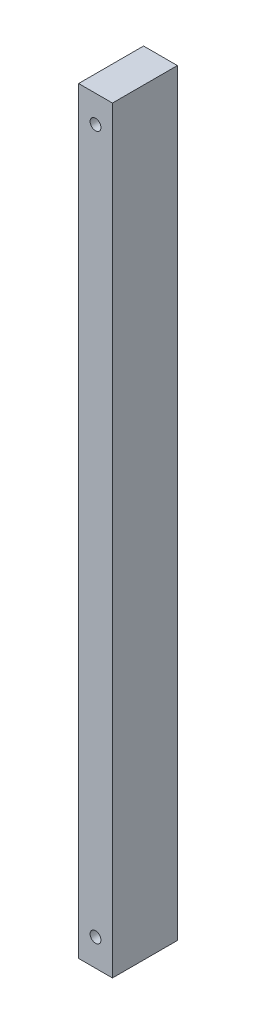
ISO-10303-21;
HEADER;
FILE_DESCRIPTION(('STEP AP214'),'2;1');
FILE_NAME('part.step','',(''),(''),'','','');
FILE_SCHEMA(('AUTOMOTIVE_DESIGN { 1 0 10303 214 1 1 1 1 }'));
ENDSEC;
DATA;
#1=APPLICATION_CONTEXT('core data for automotive mechanical design processes');
#2=APPLICATION_PROTOCOL_DEFINITION('international standard','automotive_design',2000,#1);
#3=PRODUCT_CONTEXT('',#1,'mechanical');
#4=PRODUCT('Part','Part','',(#3));
#5=PRODUCT_RELATED_PRODUCT_CATEGORY('part','',(#4));
#6=PRODUCT_DEFINITION_FORMATION('','',#4);
#7=PRODUCT_DEFINITION_CONTEXT('part definition',#1,'design');
#8=PRODUCT_DEFINITION('design','',#6,#7);
#9=PRODUCT_DEFINITION_SHAPE('','',#8);
#10=(LENGTH_UNIT() NAMED_UNIT(*) SI_UNIT(.MILLI.,.METRE.));
#11=(NAMED_UNIT(*) PLANE_ANGLE_UNIT() SI_UNIT($,.RADIAN.));
#12=(NAMED_UNIT(*) SI_UNIT($,.STERADIAN.) SOLID_ANGLE_UNIT());
#13=UNCERTAINTY_MEASURE_WITH_UNIT(LENGTH_MEASURE(1.E-05),#10,'distance_accuracy_value','');
#14=(GEOMETRIC_REPRESENTATION_CONTEXT(3) GLOBAL_UNCERTAINTY_ASSIGNED_CONTEXT((#13)) GLOBAL_UNIT_ASSIGNED_CONTEXT((#10,
#11,#12)) REPRESENTATION_CONTEXT('',''));
#15=CARTESIAN_POINT('',(0.,0.,0.));
#16=DIRECTION('',(0.,0.,1.));
#17=DIRECTION('',(1.,0.,0.));
#18=AXIS2_PLACEMENT_3D('',#15,#16,#17);
#19=CARTESIAN_POINT('',(19.84375,0.,0.));
#20=DIRECTION('',(0.,0.,-1.));
#21=DIRECTION('',(-1.,0.,0.));
#22=AXIS2_PLACEMENT_3D('',#19,#20,#21);
#23=PLANE('',#22);
#24=CARTESIAN_POINT('',(9.921875,428.625,0.));
#25=DIRECTION('',(0.,0.,1.));
#26=DIRECTION('',(1.,0.,0.));
#27=AXIS2_PLACEMENT_3D('',#24,#25,#26);
#28=CIRCLE('',#27,3.175);
#29=CARTESIAN_POINT('',(13.096875,428.625,0.));
#30=VERTEX_POINT('',#29);
#31=EDGE_CURVE('E116',#30,#30,#28,.T.);
#32=ORIENTED_EDGE('',*,*,#31,.F.);
#33=EDGE_LOOP('',(#32));
#34=FACE_BOUND('',#33,.T.);
#35=CARTESIAN_POINT('',(9.92187500000005,15.875,0.));
#36=DIRECTION('',(0.,0.,1.));
#37=DIRECTION('',(1.,0.,0.));
#38=AXIS2_PLACEMENT_3D('',#35,#36,#37);
#39=CIRCLE('',#38,3.175);
#40=CARTESIAN_POINT('',(13.0968750000001,15.875,0.));
#41=VERTEX_POINT('',#40);
#42=EDGE_CURVE('E110',#41,#41,#39,.T.);
#43=ORIENTED_EDGE('',*,*,#42,.F.);
#44=EDGE_LOOP('',(#43));
#45=FACE_BOUND('',#44,.T.);
#46=DIRECTION('',(0.,-1.,0.));
#47=VECTOR('',#46,1.);
#48=CARTESIAN_POINT('',(0.,0.,0.));
#49=LINE('',#48,#47);
#50=CARTESIAN_POINT('',(0.,444.5,0.));
#51=VERTEX_POINT('',#50);
#52=CARTESIAN_POINT('',(0.,0.,0.));
#53=VERTEX_POINT('',#52);
#54=EDGE_CURVE('E96',#51,#53,#49,.T.);
#55=ORIENTED_EDGE('',*,*,#54,.T.);
#56=DIRECTION('',(-1.,0.,0.));
#57=VECTOR('',#56,1.);
#58=CARTESIAN_POINT('',(19.84375,0.,0.));
#59=LINE('',#58,#57);
#60=CARTESIAN_POINT('',(19.84375,0.,0.));
#61=VERTEX_POINT('',#60);
#62=EDGE_CURVE('E11',#61,#53,#59,.T.);
#63=ORIENTED_EDGE('',*,*,#62,.F.);
#64=DIRECTION('',(0.,-1.,0.));
#65=VECTOR('',#64,1.);
#66=CARTESIAN_POINT('',(19.84375,0.,0.));
#67=LINE('',#66,#65);
#68=CARTESIAN_POINT('',(19.84375,444.5,0.));
#69=VERTEX_POINT('',#68);
#70=EDGE_CURVE('E84',#69,#61,#67,.T.);
#71=ORIENTED_EDGE('',*,*,#70,.F.);
#72=DIRECTION('',(-1.,0.,0.));
#73=VECTOR('',#72,1.);
#74=CARTESIAN_POINT('',(19.84375,444.5,0.));
#75=LINE('',#74,#73);
#76=EDGE_CURVE('E92',#69,#51,#75,.T.);
#77=ORIENTED_EDGE('',*,*,#76,.T.);
#78=EDGE_LOOP('',(#55,#63,#71,#77));
#79=FACE_BOUND('',#78,.T.);
#80=ADVANCED_FACE('F33',(#34,#45,#79),#23,.F.);
#81=CARTESIAN_POINT('',(19.84375,0.,0.));
#82=DIRECTION('',(0.,1.,0.));
#83=DIRECTION('',(0.,0.,1.));
#84=AXIS2_PLACEMENT_3D('',#81,#82,#83);
#85=PLANE('',#84);
#86=DIRECTION('',(0.,0.,-1.));
#87=VECTOR('',#86,1.);
#88=CARTESIAN_POINT('',(0.,0.,0.));
#89=LINE('',#88,#87);
#90=CARTESIAN_POINT('',(0.,0.,-38.1));
#91=VERTEX_POINT('',#90);
#92=EDGE_CURVE('E88',#53,#91,#89,.T.);
#93=ORIENTED_EDGE('',*,*,#92,.T.);
#94=DIRECTION('',(-1.,0.,0.));
#95=VECTOR('',#94,1.);
#96=CARTESIAN_POINT('',(19.84375,0.,-38.1));
#97=LINE('',#96,#95);
#98=CARTESIAN_POINT('',(19.84375,0.,-38.1));
#99=VERTEX_POINT('',#98);
#100=EDGE_CURVE('E41',#99,#91,#97,.T.);
#101=ORIENTED_EDGE('',*,*,#100,.F.);
#102=DIRECTION('',(0.,0.,-1.));
#103=VECTOR('',#102,1.);
#104=CARTESIAN_POINT('',(19.84375,0.,0.));
#105=LINE('',#104,#103);
#106=EDGE_CURVE('E79',#61,#99,#105,.T.);
#107=ORIENTED_EDGE('',*,*,#106,.F.);
#108=ORIENTED_EDGE('',*,*,#62,.T.);
#109=EDGE_LOOP('',(#93,#101,#107,#108));
#110=FACE_BOUND('',#109,.T.);
#111=ADVANCED_FACE('F87',(#110),#85,.F.);
#112=CARTESIAN_POINT('',(19.84375,0.,-38.1));
#113=DIRECTION('',(0.,0.,1.));
#114=DIRECTION('',(1.,0.,0.));
#115=AXIS2_PLACEMENT_3D('',#112,#113,#114);
#116=PLANE('',#115);
#117=CARTESIAN_POINT('',(9.921875,428.625,-38.1));
#118=DIRECTION('',(0.,0.,1.));
#119=DIRECTION('',(1.,0.,0.));
#120=AXIS2_PLACEMENT_3D('',#117,#118,#119);
#121=CIRCLE('',#120,3.175);
#122=CARTESIAN_POINT('',(13.096875,428.625,-38.1));
#123=VERTEX_POINT('',#122);
#124=EDGE_CURVE('E113',#123,#123,#121,.T.);
#125=ORIENTED_EDGE('',*,*,#124,.T.);
#126=EDGE_LOOP('',(#125));
#127=FACE_BOUND('',#126,.T.);
#128=CARTESIAN_POINT('',(9.92187500000005,15.875,-38.1));
#129=DIRECTION('',(0.,0.,1.));
#130=DIRECTION('',(1.,0.,0.));
#131=AXIS2_PLACEMENT_3D('',#128,#129,#130);
#132=CIRCLE('',#131,3.175);
#133=CARTESIAN_POINT('',(13.0968750000001,15.875,-38.1));
#134=VERTEX_POINT('',#133);
#135=EDGE_CURVE('E99',#134,#134,#132,.T.);
#136=ORIENTED_EDGE('',*,*,#135,.T.);
#137=EDGE_LOOP('',(#136));
#138=FACE_BOUND('',#137,.T.);
#139=DIRECTION('',(0.,1.,0.));
#140=VECTOR('',#139,1.);
#141=CARTESIAN_POINT('',(0.,0.,-38.1));
#142=LINE('',#141,#140);
#143=CARTESIAN_POINT('',(0.,444.5,-38.1));
#144=VERTEX_POINT('',#143);
#145=EDGE_CURVE('E66',#91,#144,#142,.T.);
#146=ORIENTED_EDGE('',*,*,#145,.T.);
#147=DIRECTION('',(-1.,0.,0.));
#148=VECTOR('',#147,1.);
#149=CARTESIAN_POINT('',(19.84375,444.5,-38.1));
#150=LINE('',#149,#148);
#151=CARTESIAN_POINT('',(19.84375,444.5,-38.1));
#152=VERTEX_POINT('',#151);
#153=EDGE_CURVE('E89',#152,#144,#150,.T.);
#154=ORIENTED_EDGE('',*,*,#153,.F.);
#155=DIRECTION('',(0.,1.,0.));
#156=VECTOR('',#155,1.);
#157=CARTESIAN_POINT('',(19.84375,0.,-38.1));
#158=LINE('',#157,#156);
#159=EDGE_CURVE('E82',#99,#152,#158,.T.);
#160=ORIENTED_EDGE('',*,*,#159,.F.);
#161=ORIENTED_EDGE('',*,*,#100,.T.);
#162=EDGE_LOOP('',(#146,#154,#160,#161));
#163=FACE_BOUND('',#162,.T.);
#164=ADVANCED_FACE('F90',(#127,#138,#163),#116,.F.);
#165=CARTESIAN_POINT('',(19.84375,444.5,0.));
#166=DIRECTION('',(0.,-1.,0.));
#167=DIRECTION('',(0.,0.,-1.));
#168=AXIS2_PLACEMENT_3D('',#165,#166,#167);
#169=PLANE('',#168);
#170=DIRECTION('',(0.,0.,1.));
#171=VECTOR('',#170,1.);
#172=CARTESIAN_POINT('',(0.,444.5,0.));
#173=LINE('',#172,#171);
#174=EDGE_CURVE('E72',#144,#51,#173,.T.);
#175=ORIENTED_EDGE('',*,*,#174,.T.);
#176=ORIENTED_EDGE('',*,*,#76,.F.);
#177=DIRECTION('',(0.,0.,1.));
#178=VECTOR('',#177,1.);
#179=CARTESIAN_POINT('',(19.84375,444.5,0.));
#180=LINE('',#179,#178);
#181=EDGE_CURVE('E49',#152,#69,#180,.T.);
#182=ORIENTED_EDGE('',*,*,#181,.F.);
#183=ORIENTED_EDGE('',*,*,#153,.T.);
#184=EDGE_LOOP('',(#175,#176,#182,#183));
#185=FACE_BOUND('',#184,.T.);
#186=ADVANCED_FACE('F104',(#185),#169,.F.);
#187=CARTESIAN_POINT('',(19.84375,0.,0.));
#188=DIRECTION('',(-1.,0.,0.));
#189=DIRECTION('',(0.,0.,1.));
#190=AXIS2_PLACEMENT_3D('',#187,#188,#189);
#191=PLANE('',#190);
#192=ORIENTED_EDGE('',*,*,#70,.T.);
#193=ORIENTED_EDGE('',*,*,#106,.T.);
#194=ORIENTED_EDGE('',*,*,#159,.T.);
#195=ORIENTED_EDGE('',*,*,#181,.T.);
#196=EDGE_LOOP('',(#192,#193,#194,#195));
#197=FACE_BOUND('',#196,.T.);
#198=ADVANCED_FACE('F80',(#197),#191,.F.);
#199=CARTESIAN_POINT('',(0.,0.,0.));
#200=DIRECTION('',(-1.,0.,0.));
#201=DIRECTION('',(0.,0.,1.));
#202=AXIS2_PLACEMENT_3D('',#199,#200,#201);
#203=PLANE('',#202);
#204=ORIENTED_EDGE('',*,*,#54,.F.);
#205=ORIENTED_EDGE('',*,*,#174,.F.);
#206=ORIENTED_EDGE('',*,*,#145,.F.);
#207=ORIENTED_EDGE('',*,*,#92,.F.);
#208=EDGE_LOOP('',(#204,#205,#206,#207));
#209=FACE_BOUND('',#208,.T.);
#210=ADVANCED_FACE('F107',(#209),#203,.T.);
#211=CARTESIAN_POINT('',(9.92187500000005,15.875,-38.1));
#212=DIRECTION('',(0.,0.,1.));
#213=DIRECTION('',(1.,0.,0.));
#214=AXIS2_PLACEMENT_3D('',#211,#212,#213);
#215=CYLINDRICAL_SURFACE('',#214,3.175);
#216=ORIENTED_EDGE('',*,*,#135,.F.);
#217=EDGE_LOOP('',(#216));
#218=FACE_BOUND('',#217,.T.);
#219=ORIENTED_EDGE('',*,*,#42,.T.);
#220=EDGE_LOOP('',(#219));
#221=FACE_BOUND('',#220,.T.);
#222=ADVANCED_FACE('F127',(#218,#221),#215,.F.);
#223=CARTESIAN_POINT('',(9.921875,428.625,-38.1));
#224=DIRECTION('',(0.,0.,1.));
#225=DIRECTION('',(1.,0.,0.));
#226=AXIS2_PLACEMENT_3D('',#223,#224,#225);
#227=CYLINDRICAL_SURFACE('',#226,3.175);
#228=ORIENTED_EDGE('',*,*,#124,.F.);
#229=EDGE_LOOP('',(#228));
#230=FACE_BOUND('',#229,.T.);
#231=ORIENTED_EDGE('',*,*,#31,.T.);
#232=EDGE_LOOP('',(#231));
#233=FACE_BOUND('',#232,.T.);
#234=ADVANCED_FACE('F124',(#230,#233),#227,.F.);
#235=CLOSED_SHELL('',(#80,#111,#164,#186,#198,#210,#222,#234));
#236=MANIFOLD_SOLID_BREP('B2',#235);
#237=ADVANCED_BREP_SHAPE_REPRESENTATION('',(#18,#236),#14);
#238=SHAPE_DEFINITION_REPRESENTATION(#9,#237);
ENDSEC;
END-ISO-10303-21;
